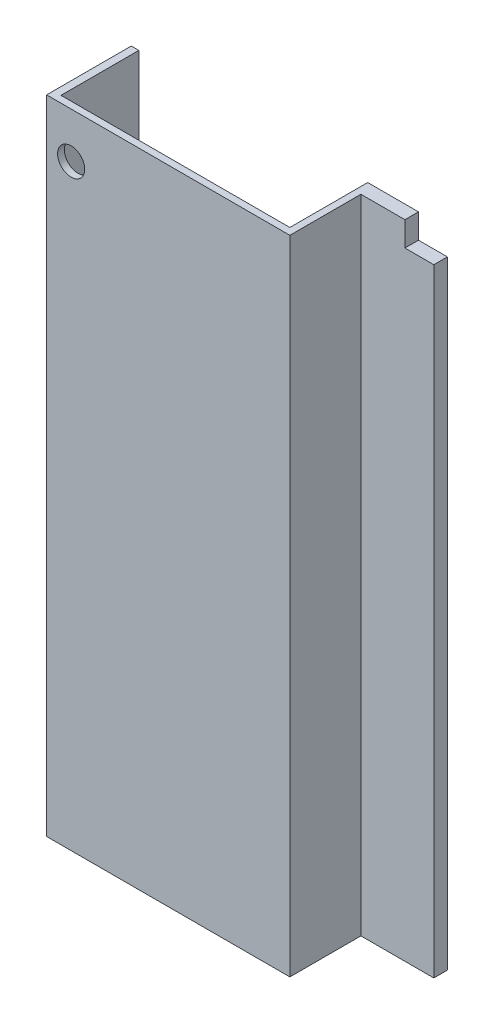
ISO-10303-21;
HEADER;
FILE_DESCRIPTION(('STEP AP214'),'2;1');
FILE_NAME('part.step','',(''),(''),'','','');
FILE_SCHEMA(('AUTOMOTIVE_DESIGN { 1 0 10303 214 1 1 1 1 }'));
ENDSEC;
DATA;
#1=APPLICATION_CONTEXT('core data for automotive mechanical design processes');
#2=APPLICATION_PROTOCOL_DEFINITION('international standard','automotive_design',2000,#1);
#3=PRODUCT_CONTEXT('',#1,'mechanical');
#4=PRODUCT('Part','Part','',(#3));
#5=PRODUCT_RELATED_PRODUCT_CATEGORY('part','',(#4));
#6=PRODUCT_DEFINITION_FORMATION('','',#4);
#7=PRODUCT_DEFINITION_CONTEXT('part definition',#1,'design');
#8=PRODUCT_DEFINITION('design','',#6,#7);
#9=PRODUCT_DEFINITION_SHAPE('','',#8);
#10=(LENGTH_UNIT() NAMED_UNIT(*) SI_UNIT(.MILLI.,.METRE.));
#11=(NAMED_UNIT(*) PLANE_ANGLE_UNIT() SI_UNIT($,.RADIAN.));
#12=(NAMED_UNIT(*) SI_UNIT($,.STERADIAN.) SOLID_ANGLE_UNIT());
#13=UNCERTAINTY_MEASURE_WITH_UNIT(LENGTH_MEASURE(1.E-05),#10,'distance_accuracy_value','');
#14=(GEOMETRIC_REPRESENTATION_CONTEXT(3) GLOBAL_UNCERTAINTY_ASSIGNED_CONTEXT((#13)) GLOBAL_UNIT_ASSIGNED_CONTEXT((#10,
#11,#12)) REPRESENTATION_CONTEXT('',''));
#15=CARTESIAN_POINT('',(0.,0.,0.));
#16=DIRECTION('',(0.,0.,1.));
#17=DIRECTION('',(1.,0.,0.));
#18=AXIS2_PLACEMENT_3D('',#15,#16,#17);
#19=CARTESIAN_POINT('',(-457.073,2405.888,25.4000000000001));
#20=DIRECTION('',(1.,0.,0.));
#21=DIRECTION('',(0.,0.,-1.));
#22=AXIS2_PLACEMENT_3D('',#19,#20,#21);
#23=PLANE('',#22);
#24=DIRECTION('',(0.,0.,1.));
#25=VECTOR('',#24,1.);
#26=CARTESIAN_POINT('',(-457.073,0.,25.4000000000001));
#27=LINE('',#26,#25);
#28=CARTESIAN_POINT('',(-457.073,0.,-291.592));
#29=VERTEX_POINT('',#28);
#30=CARTESIAN_POINT('',(-457.073,0.,25.4000000000001));
#31=VERTEX_POINT('',#30);
#32=EDGE_CURVE('E148',#29,#31,#27,.T.);
#33=ORIENTED_EDGE('',*,*,#32,.T.);
#34=DIRECTION('',(0.,-1.,0.));
#35=VECTOR('',#34,1.);
#36=CARTESIAN_POINT('',(-457.073,2405.888,25.4000000000001));
#37=LINE('',#36,#35);
#38=CARTESIAN_POINT('',(-457.073,2405.888,25.4000000000001));
#39=VERTEX_POINT('',#38);
#40=EDGE_CURVE('E11',#39,#31,#37,.T.);
#41=ORIENTED_EDGE('',*,*,#40,.F.);
#42=DIRECTION('',(0.,0.,1.));
#43=VECTOR('',#42,1.);
#44=CARTESIAN_POINT('',(-457.073,2405.888,25.4000000000001));
#45=LINE('',#44,#43);
#46=CARTESIAN_POINT('',(-457.073,2405.888,-291.592));
#47=VERTEX_POINT('',#46);
#48=EDGE_CURVE('E170',#47,#39,#45,.T.);
#49=ORIENTED_EDGE('',*,*,#48,.F.);
#50=DIRECTION('',(0.,-1.,0.));
#51=VECTOR('',#50,1.);
#52=CARTESIAN_POINT('',(-457.073,2405.888,-291.592));
#53=LINE('',#52,#51);
#54=EDGE_CURVE('E144',#47,#29,#53,.T.);
#55=ORIENTED_EDGE('',*,*,#54,.T.);
#56=EDGE_LOOP('',(#33,#41,#49,#55));
#57=FACE_BOUND('',#56,.T.);
#58=ADVANCED_FACE('F34',(#57),#23,.F.);
#59=CARTESIAN_POINT('',(454.025,2405.888,25.4));
#60=DIRECTION('',(0.,0.,-1.));
#61=DIRECTION('',(-1.,0.,0.));
#62=AXIS2_PLACEMENT_3D('',#59,#60,#61);
#63=PLANE('',#62);
#64=CARTESIAN_POINT('',(-365.125,2235.708,25.4000000000001));
#65=DIRECTION('',(0.,0.,1.));
#66=DIRECTION('',(1.,0.,0.));
#67=AXIS2_PLACEMENT_3D('',#64,#65,#66);
#68=CIRCLE('',#67,50.8);
#69=CARTESIAN_POINT('',(-314.325,2235.708,25.4000000000001));
#70=VERTEX_POINT('',#69);
#71=EDGE_CURVE('E232',#70,#70,#68,.T.);
#72=ORIENTED_EDGE('',*,*,#71,.F.);
#73=EDGE_LOOP('',(#72));
#74=FACE_BOUND('',#73,.T.);
#75=DIRECTION('',(1.,0.,0.));
#76=VECTOR('',#75,1.);
#77=CARTESIAN_POINT('',(454.025,0.,25.4));
#78=LINE('',#77,#76);
#79=CARTESIAN_POINT('',(454.025,0.,25.4));
#80=VERTEX_POINT('',#79);
#81=EDGE_CURVE('E151',#31,#80,#78,.T.);
#82=ORIENTED_EDGE('',*,*,#81,.T.);
#83=DIRECTION('',(0.,-1.,0.));
#84=VECTOR('',#83,1.);
#85=CARTESIAN_POINT('',(454.025,2405.888,25.4));
#86=LINE('',#85,#84);
#87=CARTESIAN_POINT('',(454.025,2405.888,25.4));
#88=VERTEX_POINT('',#87);
#89=EDGE_CURVE('E41',#88,#80,#86,.T.);
#90=ORIENTED_EDGE('',*,*,#89,.F.);
#91=DIRECTION('',(1.,0.,0.));
#92=VECTOR('',#91,1.);
#93=CARTESIAN_POINT('',(454.025,2405.888,25.4));
#94=LINE('',#93,#92);
#95=EDGE_CURVE('E104',#39,#88,#94,.T.);
#96=ORIENTED_EDGE('',*,*,#95,.F.);
#97=ORIENTED_EDGE('',*,*,#40,.T.);
#98=EDGE_LOOP('',(#82,#90,#96,#97));
#99=FACE_BOUND('',#98,.T.);
#100=ADVANCED_FACE('F238',(#74,#99),#63,.F.);
#101=CARTESIAN_POINT('',(454.025,2405.888,-240.792));
#102=DIRECTION('',(-1.,0.,0.));
#103=DIRECTION('',(0.,0.,1.));
#104=AXIS2_PLACEMENT_3D('',#101,#102,#103);
#105=PLANE('',#104);
#106=DIRECTION('',(0.,0.,-1.));
#107=VECTOR('',#106,1.);
#108=CARTESIAN_POINT('',(454.025,0.,-240.792));
#109=LINE('',#108,#107);
#110=CARTESIAN_POINT('',(454.025,0.,-240.792));
#111=VERTEX_POINT('',#110);
#112=EDGE_CURVE('E154',#80,#111,#109,.T.);
#113=ORIENTED_EDGE('',*,*,#112,.T.);
#114=DIRECTION('',(0.,-1.,0.));
#115=VECTOR('',#114,1.);
#116=CARTESIAN_POINT('',(454.025,2405.888,-240.792));
#117=LINE('',#116,#115);
#118=CARTESIAN_POINT('',(454.025,2405.888,-240.792));
#119=VERTEX_POINT('',#118);
#120=EDGE_CURVE('E181',#119,#111,#117,.T.);
#121=ORIENTED_EDGE('',*,*,#120,.F.);
#122=DIRECTION('',(0.,0.,-1.));
#123=VECTOR('',#122,1.);
#124=CARTESIAN_POINT('',(454.025,2405.888,-240.792));
#125=LINE('',#124,#123);
#126=EDGE_CURVE('E189',#88,#119,#125,.T.);
#127=ORIENTED_EDGE('',*,*,#126,.F.);
#128=ORIENTED_EDGE('',*,*,#89,.T.);
#129=EDGE_LOOP('',(#113,#121,#127,#128));
#130=FACE_BOUND('',#129,.T.);
#131=ADVANCED_FACE('F187',(#130),#105,.F.);
#132=CARTESIAN_POINT('',(727.075,2405.888,-240.792));
#133=DIRECTION('',(0.,0.,-1.));
#134=DIRECTION('',(-1.,0.,0.));
#135=AXIS2_PLACEMENT_3D('',#132,#133,#134);
#136=PLANE('',#135);
#137=DIRECTION('',(1.,0.,0.));
#138=VECTOR('',#137,1.);
#139=CARTESIAN_POINT('',(727.075,2313.94,-240.792));
#140=LINE('',#139,#138);
#141=CARTESIAN_POINT('',(618.871,2313.94,-240.792));
#142=VERTEX_POINT('',#141);
#143=CARTESIAN_POINT('',(727.075,2313.94,-240.792));
#144=VERTEX_POINT('',#143);
#145=EDGE_CURVE('E220',#142,#144,#140,.T.);
#146=ORIENTED_EDGE('',*,*,#145,.F.);
#147=DIRECTION('',(0.,-1.,0.));
#148=VECTOR('',#147,1.);
#149=CARTESIAN_POINT('',(618.871,2405.888,-240.792));
#150=LINE('',#149,#148);
#151=CARTESIAN_POINT('',(618.871,2405.888,-240.792));
#152=VERTEX_POINT('',#151);
#153=EDGE_CURVE('E206',#152,#142,#150,.T.);
#154=ORIENTED_EDGE('',*,*,#153,.F.);
#155=DIRECTION('',(1.,0.,0.));
#156=VECTOR('',#155,1.);
#157=CARTESIAN_POINT('',(727.075,2405.888,-240.792));
#158=LINE('',#157,#156);
#159=EDGE_CURVE('E203',#119,#152,#158,.T.);
#160=ORIENTED_EDGE('',*,*,#159,.F.);
#161=ORIENTED_EDGE('',*,*,#120,.T.);
#162=DIRECTION('',(1.,0.,0.));
#163=VECTOR('',#162,1.);
#164=CARTESIAN_POINT('',(727.075,0.,-240.792));
#165=LINE('',#164,#163);
#166=CARTESIAN_POINT('',(727.075,0.,-240.792));
#167=VERTEX_POINT('',#166);
#168=EDGE_CURVE('E156',#111,#167,#165,.T.);
#169=ORIENTED_EDGE('',*,*,#168,.T.);
#170=DIRECTION('',(0.,-1.,0.));
#171=VECTOR('',#170,1.);
#172=CARTESIAN_POINT('',(727.075,2405.888,-240.792));
#173=LINE('',#172,#171);
#174=EDGE_CURVE('E179',#144,#167,#173,.T.);
#175=ORIENTED_EDGE('',*,*,#174,.F.);
#176=EDGE_LOOP('',(#146,#154,#160,#161,#169,#175));
#177=FACE_BOUND('',#176,.T.);
#178=ADVANCED_FACE('F199',(#177),#136,.F.);
#179=CARTESIAN_POINT('',(727.075,2405.888,-291.592));
#180=DIRECTION('',(-1.,0.,0.));
#181=DIRECTION('',(0.,0.,1.));
#182=AXIS2_PLACEMENT_3D('',#179,#180,#181);
#183=PLANE('',#182);
#184=DIRECTION('',(0.,-1.,0.));
#185=VECTOR('',#184,1.);
#186=CARTESIAN_POINT('',(727.075,2405.888,-291.592));
#187=LINE('',#186,#185);
#188=CARTESIAN_POINT('',(727.075,2313.94,-291.592));
#189=VERTEX_POINT('',#188);
#190=CARTESIAN_POINT('',(727.075,0.,-291.592));
#191=VERTEX_POINT('',#190);
#192=EDGE_CURVE('E177',#189,#191,#187,.T.);
#193=ORIENTED_EDGE('',*,*,#192,.F.);
#194=DIRECTION('',(0.,0.,1.));
#195=VECTOR('',#194,1.);
#196=CARTESIAN_POINT('',(727.075,2313.94,-433.58686018867));
#197=LINE('',#196,#195);
#198=EDGE_CURVE('E219',#189,#144,#197,.T.);
#199=ORIENTED_EDGE('',*,*,#198,.T.);
#200=ORIENTED_EDGE('',*,*,#174,.T.);
#201=DIRECTION('',(0.,0.,-1.));
#202=VECTOR('',#201,1.);
#203=CARTESIAN_POINT('',(727.075,0.,-291.592));
#204=LINE('',#203,#202);
#205=EDGE_CURVE('E159',#167,#191,#204,.T.);
#206=ORIENTED_EDGE('',*,*,#205,.T.);
#207=EDGE_LOOP('',(#193,#199,#200,#206));
#208=FACE_BOUND('',#207,.T.);
#209=ADVANCED_FACE('F278',(#208),#183,.F.);
#210=CARTESIAN_POINT('',(428.625,2405.888,-291.592));
#211=DIRECTION('',(0.,0.,1.));
#212=DIRECTION('',(1.,0.,0.));
#213=AXIS2_PLACEMENT_3D('',#210,#211,#212);
#214=PLANE('',#213);
#215=DIRECTION('',(-1.,0.,0.));
#216=VECTOR('',#215,1.);
#217=CARTESIAN_POINT('',(428.625,2405.888,-291.592));
#218=LINE('',#217,#216);
#219=CARTESIAN_POINT('',(618.871,2405.888,-291.592));
#220=VERTEX_POINT('',#219);
#221=CARTESIAN_POINT('',(428.625,2405.888,-291.592));
#222=VERTEX_POINT('',#221);
#223=EDGE_CURVE('E207',#220,#222,#218,.T.);
#224=ORIENTED_EDGE('',*,*,#223,.F.);
#225=DIRECTION('',(0.,1.,0.));
#226=VECTOR('',#225,1.);
#227=CARTESIAN_POINT('',(618.871,2405.888,-291.592));
#228=LINE('',#227,#226);
#229=CARTESIAN_POINT('',(618.871,2313.94,-291.592));
#230=VERTEX_POINT('',#229);
#231=EDGE_CURVE('E48',#230,#220,#228,.T.);
#232=ORIENTED_EDGE('',*,*,#231,.F.);
#233=DIRECTION('',(-1.,0.,0.));
#234=VECTOR('',#233,1.);
#235=CARTESIAN_POINT('',(727.075,2313.94,-291.592));
#236=LINE('',#235,#234);
#237=EDGE_CURVE('E152',#189,#230,#236,.T.);
#238=ORIENTED_EDGE('',*,*,#237,.F.);
#239=ORIENTED_EDGE('',*,*,#192,.T.);
#240=DIRECTION('',(-1.,0.,0.));
#241=VECTOR('',#240,1.);
#242=CARTESIAN_POINT('',(428.625,0.,-291.592));
#243=LINE('',#242,#241);
#244=CARTESIAN_POINT('',(428.625,0.,-291.592));
#245=VERTEX_POINT('',#244);
#246=EDGE_CURVE('E162',#191,#245,#243,.T.);
#247=ORIENTED_EDGE('',*,*,#246,.T.);
#248=DIRECTION('',(0.,-1.,0.));
#249=VECTOR('',#248,1.);
#250=CARTESIAN_POINT('',(428.625,2405.888,-291.592));
#251=LINE('',#250,#249);
#252=EDGE_CURVE('E174',#222,#245,#251,.T.);
#253=ORIENTED_EDGE('',*,*,#252,.F.);
#254=EDGE_LOOP('',(#224,#232,#238,#239,#247,#253));
#255=FACE_BOUND('',#254,.T.);
#256=ADVANCED_FACE('F286',(#255),#214,.F.);
#257=CARTESIAN_POINT('',(428.625,2405.888,-1.52655665885959E-13));
#258=DIRECTION('',(1.,0.,0.));
#259=DIRECTION('',(0.,0.,-1.));
#260=AXIS2_PLACEMENT_3D('',#257,#258,#259);
#261=PLANE('',#260);
#262=DIRECTION('',(0.,0.,1.));
#263=VECTOR('',#262,1.);
#264=CARTESIAN_POINT('',(428.625,0.,-1.52655665885959E-13));
#265=LINE('',#264,#263);
#266=CARTESIAN_POINT('',(428.625,0.,-1.52655665885959E-13));
#267=VERTEX_POINT('',#266);
#268=EDGE_CURVE('E164',#245,#267,#265,.T.);
#269=ORIENTED_EDGE('',*,*,#268,.T.);
#270=DIRECTION('',(0.,-1.,0.));
#271=VECTOR('',#270,1.);
#272=CARTESIAN_POINT('',(428.625,2405.888,-1.52655665885959E-13));
#273=LINE('',#272,#271);
#274=CARTESIAN_POINT('',(428.625,2405.888,-1.52655665885959E-13));
#275=VERTEX_POINT('',#274);
#276=EDGE_CURVE('E139',#275,#267,#273,.T.);
#277=ORIENTED_EDGE('',*,*,#276,.F.);
#278=DIRECTION('',(0.,0.,1.));
#279=VECTOR('',#278,1.);
#280=CARTESIAN_POINT('',(428.625,2405.888,-1.52655665885959E-13));
#281=LINE('',#280,#279);
#282=EDGE_CURVE('E127',#222,#275,#281,.T.);
#283=ORIENTED_EDGE('',*,*,#282,.F.);
#284=ORIENTED_EDGE('',*,*,#252,.T.);
#285=EDGE_LOOP('',(#269,#277,#283,#284));
#286=FACE_BOUND('',#285,.T.);
#287=ADVANCED_FACE('F294',(#286),#261,.F.);
#288=CARTESIAN_POINT('',(-428.625,2405.888,0.));
#289=DIRECTION('',(0.,0.,1.));
#290=DIRECTION('',(1.,0.,0.));
#291=AXIS2_PLACEMENT_3D('',#288,#289,#290);
#292=PLANE('',#291);
#293=CARTESIAN_POINT('',(-365.125,2235.708,0.));
#294=DIRECTION('',(0.,0.,1.));
#295=DIRECTION('',(1.,0.,0.));
#296=AXIS2_PLACEMENT_3D('',#293,#294,#295);
#297=CIRCLE('',#296,50.8);
#298=CARTESIAN_POINT('',(-314.325,2235.708,0.));
#299=VERTEX_POINT('',#298);
#300=EDGE_CURVE('E228',#299,#299,#297,.F.);
#301=ORIENTED_EDGE('',*,*,#300,.F.);
#302=EDGE_LOOP('',(#301));
#303=FACE_BOUND('',#302,.T.);
#304=DIRECTION('',(-1.,0.,0.));
#305=VECTOR('',#304,1.);
#306=CARTESIAN_POINT('',(-428.625,0.,0.));
#307=LINE('',#306,#305);
#308=CARTESIAN_POINT('',(-428.625,0.,0.));
#309=VERTEX_POINT('',#308);
#310=EDGE_CURVE('E136',#267,#309,#307,.T.);
#311=ORIENTED_EDGE('',*,*,#310,.T.);
#312=DIRECTION('',(0.,-1.,0.));
#313=VECTOR('',#312,1.);
#314=CARTESIAN_POINT('',(-428.625,2405.888,0.));
#315=LINE('',#314,#313);
#316=CARTESIAN_POINT('',(-428.625,2405.888,0.));
#317=VERTEX_POINT('',#316);
#318=EDGE_CURVE('E133',#317,#309,#315,.T.);
#319=ORIENTED_EDGE('',*,*,#318,.F.);
#320=DIRECTION('',(-1.,0.,0.));
#321=VECTOR('',#320,1.);
#322=CARTESIAN_POINT('',(-428.625,2405.888,0.));
#323=LINE('',#322,#321);
#324=EDGE_CURVE('E119',#275,#317,#323,.T.);
#325=ORIENTED_EDGE('',*,*,#324,.F.);
#326=ORIENTED_EDGE('',*,*,#276,.T.);
#327=EDGE_LOOP('',(#311,#319,#325,#326));
#328=FACE_BOUND('',#327,.T.);
#329=ADVANCED_FACE('F134',(#303,#328),#292,.F.);
#330=CARTESIAN_POINT('',(-428.625,2405.888,-291.592));
#331=DIRECTION('',(-1.,0.,0.));
#332=DIRECTION('',(0.,0.,1.));
#333=AXIS2_PLACEMENT_3D('',#330,#331,#332);
#334=PLANE('',#333);
#335=DIRECTION('',(0.,0.,-1.));
#336=VECTOR('',#335,1.);
#337=CARTESIAN_POINT('',(-428.625,0.,-291.592));
#338=LINE('',#337,#336);
#339=CARTESIAN_POINT('',(-428.625,0.,-291.592));
#340=VERTEX_POINT('',#339);
#341=EDGE_CURVE('E167',#309,#340,#338,.T.);
#342=ORIENTED_EDGE('',*,*,#341,.T.);
#343=DIRECTION('',(0.,-1.,0.));
#344=VECTOR('',#343,1.);
#345=CARTESIAN_POINT('',(-428.625,2405.888,-291.592));
#346=LINE('',#345,#344);
#347=CARTESIAN_POINT('',(-428.625,2405.888,-291.592));
#348=VERTEX_POINT('',#347);
#349=EDGE_CURVE('E140',#348,#340,#346,.T.);
#350=ORIENTED_EDGE('',*,*,#349,.F.);
#351=DIRECTION('',(0.,0.,-1.));
#352=VECTOR('',#351,1.);
#353=CARTESIAN_POINT('',(-428.625,2405.888,-291.592));
#354=LINE('',#353,#352);
#355=EDGE_CURVE('E124',#317,#348,#354,.T.);
#356=ORIENTED_EDGE('',*,*,#355,.F.);
#357=ORIENTED_EDGE('',*,*,#318,.T.);
#358=EDGE_LOOP('',(#342,#350,#356,#357));
#359=FACE_BOUND('',#358,.T.);
#360=ADVANCED_FACE('F142',(#359),#334,.F.);
#361=CARTESIAN_POINT('',(-457.073,2405.888,-291.592));
#362=DIRECTION('',(0.,0.,1.));
#363=DIRECTION('',(1.,0.,0.));
#364=AXIS2_PLACEMENT_3D('',#361,#362,#363);
#365=PLANE('',#364);
#366=DIRECTION('',(-1.,0.,0.));
#367=VECTOR('',#366,1.);
#368=CARTESIAN_POINT('',(-457.073,0.,-291.592));
#369=LINE('',#368,#367);
#370=EDGE_CURVE('E96',#340,#29,#369,.T.);
#371=ORIENTED_EDGE('',*,*,#370,.T.);
#372=ORIENTED_EDGE('',*,*,#54,.F.);
#373=DIRECTION('',(-1.,0.,0.));
#374=VECTOR('',#373,1.);
#375=CARTESIAN_POINT('',(-457.073,2405.888,-291.592));
#376=LINE('',#375,#374);
#377=EDGE_CURVE('E57',#348,#47,#376,.T.);
#378=ORIENTED_EDGE('',*,*,#377,.F.);
#379=ORIENTED_EDGE('',*,*,#349,.T.);
#380=EDGE_LOOP('',(#371,#372,#378,#379));
#381=FACE_BOUND('',#380,.T.);
#382=ADVANCED_FACE('F244',(#381),#365,.F.);
#383=CARTESIAN_POINT('',(0.,2405.888,0.));
#384=DIRECTION('',(0.,-1.,0.));
#385=DIRECTION('',(0.,0.,-1.));
#386=AXIS2_PLACEMENT_3D('',#383,#384,#385);
#387=PLANE('',#386);
#388=ORIENTED_EDGE('',*,*,#159,.T.);
#389=DIRECTION('',(0.,0.,1.));
#390=VECTOR('',#389,1.);
#391=CARTESIAN_POINT('',(618.871,2405.888,-433.58686018867));
#392=LINE('',#391,#390);
#393=EDGE_CURVE('E223',#220,#152,#392,.T.);
#394=ORIENTED_EDGE('',*,*,#393,.F.);
#395=ORIENTED_EDGE('',*,*,#223,.T.);
#396=ORIENTED_EDGE('',*,*,#282,.T.);
#397=ORIENTED_EDGE('',*,*,#324,.T.);
#398=ORIENTED_EDGE('',*,*,#355,.T.);
#399=ORIENTED_EDGE('',*,*,#377,.T.);
#400=ORIENTED_EDGE('',*,*,#48,.T.);
#401=ORIENTED_EDGE('',*,*,#95,.T.);
#402=ORIENTED_EDGE('',*,*,#126,.T.);
#403=EDGE_LOOP('',(#388,#394,#395,#396,#397,#398,#399,#400,#401,#402));
#404=FACE_BOUND('',#403,.T.);
#405=ADVANCED_FACE('F122',(#404),#387,.F.);
#406=CARTESIAN_POINT('',(0.,0.,0.));
#407=DIRECTION('',(0.,-1.,0.));
#408=DIRECTION('',(0.,0.,-1.));
#409=AXIS2_PLACEMENT_3D('',#406,#407,#408);
#410=PLANE('',#409);
#411=ORIENTED_EDGE('',*,*,#32,.F.);
#412=ORIENTED_EDGE('',*,*,#370,.F.);
#413=ORIENTED_EDGE('',*,*,#341,.F.);
#414=ORIENTED_EDGE('',*,*,#310,.F.);
#415=ORIENTED_EDGE('',*,*,#268,.F.);
#416=ORIENTED_EDGE('',*,*,#246,.F.);
#417=ORIENTED_EDGE('',*,*,#205,.F.);
#418=ORIENTED_EDGE('',*,*,#168,.F.);
#419=ORIENTED_EDGE('',*,*,#112,.F.);
#420=ORIENTED_EDGE('',*,*,#81,.F.);
#421=EDGE_LOOP('',(#411,#412,#413,#414,#415,#416,#417,#418,#419,#420));
#422=FACE_BOUND('',#421,.T.);
#423=ADVANCED_FACE('F193',(#422),#410,.T.);
#424=CARTESIAN_POINT('',(618.871,2405.888,-433.58686018867));
#425=DIRECTION('',(-1.,0.,0.));
#426=DIRECTION('',(0.,0.,1.));
#427=AXIS2_PLACEMENT_3D('',#424,#425,#426);
#428=PLANE('',#427);
#429=ORIENTED_EDGE('',*,*,#231,.T.);
#430=ORIENTED_EDGE('',*,*,#393,.T.);
#431=ORIENTED_EDGE('',*,*,#153,.T.);
#432=DIRECTION('',(0.,0.,1.));
#433=VECTOR('',#432,1.);
#434=CARTESIAN_POINT('',(618.871,2313.94,-433.58686018867));
#435=LINE('',#434,#433);
#436=EDGE_CURVE('E216',#230,#142,#435,.T.);
#437=ORIENTED_EDGE('',*,*,#436,.F.);
#438=EDGE_LOOP('',(#429,#430,#431,#437));
#439=FACE_BOUND('',#438,.T.);
#440=ADVANCED_FACE('F328',(#439),#428,.F.);
#441=CARTESIAN_POINT('',(727.075,2313.94,-433.58686018867));
#442=DIRECTION('',(0.,-1.,0.));
#443=DIRECTION('',(0.,0.,-1.));
#444=AXIS2_PLACEMENT_3D('',#441,#442,#443);
#445=PLANE('',#444);
#446=ORIENTED_EDGE('',*,*,#237,.T.);
#447=ORIENTED_EDGE('',*,*,#436,.T.);
#448=ORIENTED_EDGE('',*,*,#145,.T.);
#449=ORIENTED_EDGE('',*,*,#198,.F.);
#450=EDGE_LOOP('',(#446,#447,#448,#449));
#451=FACE_BOUND('',#450,.T.);
#452=ADVANCED_FACE('F338',(#451),#445,.F.);
#453=CARTESIAN_POINT('',(-365.125,2235.708,-143.684097937107));
#454=DIRECTION('',(0.,0.,1.));
#455=DIRECTION('',(1.,0.,0.));
#456=AXIS2_PLACEMENT_3D('',#453,#454,#455);
#457=CYLINDRICAL_SURFACE('',#456,50.8);
#458=ORIENTED_EDGE('',*,*,#300,.T.);
#459=EDGE_LOOP('',(#458));
#460=FACE_BOUND('',#459,.T.);
#461=ORIENTED_EDGE('',*,*,#71,.T.);
#462=EDGE_LOOP('',(#461));
#463=FACE_BOUND('',#462,.T.);
#464=ADVANCED_FACE('F236',(#460,#463),#457,.F.);
#465=CLOSED_SHELL('',(#58,#100,#131,#178,#209,#256,#287,#329,#360,#382,#405,#423,#440,#452,#464));
#466=MANIFOLD_SOLID_BREP('B2',#465);
#467=ADVANCED_BREP_SHAPE_REPRESENTATION('',(#18,#466),#14);
#468=SHAPE_DEFINITION_REPRESENTATION(#9,#467);
ENDSEC;
END-ISO-10303-21;
